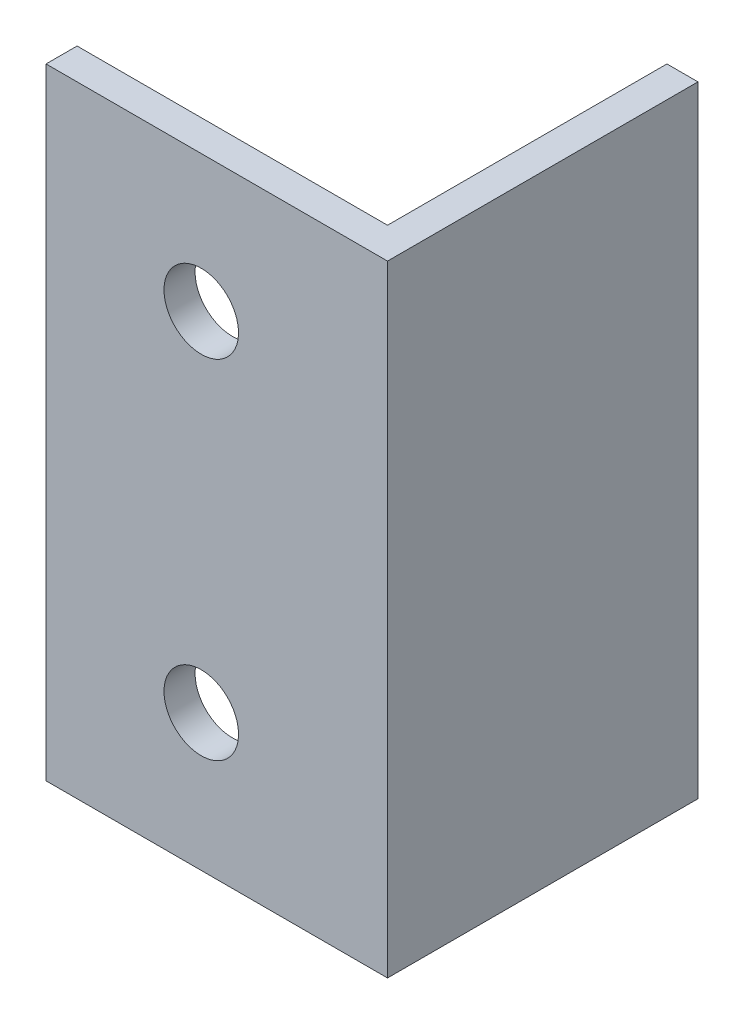
ISO-10303-21;
HEADER;
FILE_DESCRIPTION(('STEP AP214'),'2;1');
FILE_NAME('part.step','',(''),(''),'','','');
FILE_SCHEMA(('AUTOMOTIVE_DESIGN { 1 0 10303 214 1 1 1 1 }'));
ENDSEC;
DATA;
#1=APPLICATION_CONTEXT('core data for automotive mechanical design processes');
#2=APPLICATION_PROTOCOL_DEFINITION('international standard','automotive_design',2000,#1);
#3=PRODUCT_CONTEXT('',#1,'mechanical');
#4=PRODUCT('Part','Part','',(#3));
#5=PRODUCT_RELATED_PRODUCT_CATEGORY('part','',(#4));
#6=PRODUCT_DEFINITION_FORMATION('','',#4);
#7=PRODUCT_DEFINITION_CONTEXT('part definition',#1,'design');
#8=PRODUCT_DEFINITION('design','',#6,#7);
#9=PRODUCT_DEFINITION_SHAPE('','',#8);
#10=(LENGTH_UNIT() NAMED_UNIT(*) SI_UNIT(.MILLI.,.METRE.));
#11=(NAMED_UNIT(*) PLANE_ANGLE_UNIT() SI_UNIT($,.RADIAN.));
#12=(NAMED_UNIT(*) SI_UNIT($,.STERADIAN.) SOLID_ANGLE_UNIT());
#13=UNCERTAINTY_MEASURE_WITH_UNIT(LENGTH_MEASURE(1.E-05),#10,'distance_accuracy_value','');
#14=(GEOMETRIC_REPRESENTATION_CONTEXT(3) GLOBAL_UNCERTAINTY_ASSIGNED_CONTEXT((#13)) GLOBAL_UNIT_ASSIGNED_CONTEXT((#10,
#11,#12)) REPRESENTATION_CONTEXT('',''));
#15=CARTESIAN_POINT('',(0.,0.,0.));
#16=DIRECTION('',(0.,0.,1.));
#17=DIRECTION('',(1.,0.,0.));
#18=AXIS2_PLACEMENT_3D('',#15,#16,#17);
#19=CARTESIAN_POINT('',(0.,100.,5.));
#20=DIRECTION('',(1.,0.,0.));
#21=DIRECTION('',(0.,0.,-1.));
#22=AXIS2_PLACEMENT_3D('',#19,#20,#21);
#23=PLANE('',#22);
#24=DIRECTION('',(0.,0.,1.));
#25=VECTOR('',#24,1.);
#26=CARTESIAN_POINT('',(0.,0.,5.));
#27=LINE('',#26,#25);
#28=CARTESIAN_POINT('',(0.,0.,0.));
#29=VERTEX_POINT('',#28);
#30=CARTESIAN_POINT('',(0.,0.,5.));
#31=VERTEX_POINT('',#30);
#32=EDGE_CURVE('E128',#29,#31,#27,.T.);
#33=ORIENTED_EDGE('',*,*,#32,.T.);
#34=DIRECTION('',(0.,-1.,0.));
#35=VECTOR('',#34,1.);
#36=CARTESIAN_POINT('',(0.,100.,5.));
#37=LINE('',#36,#35);
#38=CARTESIAN_POINT('',(0.,100.,5.));
#39=VERTEX_POINT('',#38);
#40=EDGE_CURVE('E11',#39,#31,#37,.T.);
#41=ORIENTED_EDGE('',*,*,#40,.F.);
#42=DIRECTION('',(0.,0.,1.));
#43=VECTOR('',#42,1.);
#44=CARTESIAN_POINT('',(0.,100.,5.));
#45=LINE('',#44,#43);
#46=CARTESIAN_POINT('',(0.,100.,0.));
#47=VERTEX_POINT('',#46);
#48=EDGE_CURVE('E145',#47,#39,#45,.T.);
#49=ORIENTED_EDGE('',*,*,#48,.F.);
#50=DIRECTION('',(0.,-1.,0.));
#51=VECTOR('',#50,1.);
#52=CARTESIAN_POINT('',(0.,100.,0.));
#53=LINE('',#52,#51);
#54=EDGE_CURVE('E124',#47,#29,#53,.T.);
#55=ORIENTED_EDGE('',*,*,#54,.T.);
#56=EDGE_LOOP('',(#33,#41,#49,#55));
#57=FACE_BOUND('',#56,.T.);
#58=ADVANCED_FACE('F39',(#57),#23,.F.);
#59=CARTESIAN_POINT('',(55.,100.,4.99999999999999));
#60=DIRECTION('',(0.,0.,-1.));
#61=DIRECTION('',(-1.,0.,0.));
#62=AXIS2_PLACEMENT_3D('',#59,#60,#61);
#63=PLANE('',#62);
#64=CARTESIAN_POINT('',(25.,22.,4.99999999999999));
#65=DIRECTION('',(0.,0.,-1.));
#66=DIRECTION('',(-1.,0.,0.));
#67=AXIS2_PLACEMENT_3D('',#64,#65,#66);
#68=CIRCLE('',#67,6.);
#69=CARTESIAN_POINT('',(19.,22.,4.99999999999999));
#70=VERTEX_POINT('',#69);
#71=EDGE_CURVE('E133',#70,#70,#68,.T.);
#72=ORIENTED_EDGE('',*,*,#71,.T.);
#73=EDGE_LOOP('',(#72));
#74=FACE_BOUND('',#73,.T.);
#75=CARTESIAN_POINT('',(25.,78.,4.99999999999999));
#76=DIRECTION('',(0.,0.,-1.));
#77=DIRECTION('',(-1.,0.,0.));
#78=AXIS2_PLACEMENT_3D('',#75,#76,#77);
#79=CIRCLE('',#78,6.);
#80=CARTESIAN_POINT('',(19.,78.,4.99999999999999));
#81=VERTEX_POINT('',#80);
#82=EDGE_CURVE('E249',#81,#81,#79,.T.);
#83=ORIENTED_EDGE('',*,*,#82,.T.);
#84=EDGE_LOOP('',(#83));
#85=FACE_BOUND('',#84,.T.);
#86=DIRECTION('',(1.,0.,0.));
#87=VECTOR('',#86,1.);
#88=CARTESIAN_POINT('',(55.,0.,4.99999999999999));
#89=LINE('',#88,#87);
#90=CARTESIAN_POINT('',(55.,0.,4.99999999999999));
#91=VERTEX_POINT('',#90);
#92=EDGE_CURVE('E132',#31,#91,#89,.T.);
#93=ORIENTED_EDGE('',*,*,#92,.T.);
#94=DIRECTION('',(0.,-1.,0.));
#95=VECTOR('',#94,1.);
#96=CARTESIAN_POINT('',(55.,100.,4.99999999999999));
#97=LINE('',#96,#95);
#98=CARTESIAN_POINT('',(55.,100.,4.99999999999999));
#99=VERTEX_POINT('',#98);
#100=EDGE_CURVE('E48',#99,#91,#97,.T.);
#101=ORIENTED_EDGE('',*,*,#100,.F.);
#102=DIRECTION('',(1.,0.,0.));
#103=VECTOR('',#102,1.);
#104=CARTESIAN_POINT('',(55.,100.,4.99999999999999));
#105=LINE('',#104,#103);
#106=EDGE_CURVE('E93',#39,#99,#105,.T.);
#107=ORIENTED_EDGE('',*,*,#106,.F.);
#108=ORIENTED_EDGE('',*,*,#40,.T.);
#109=EDGE_LOOP('',(#93,#101,#107,#108));
#110=FACE_BOUND('',#109,.T.);
#111=ADVANCED_FACE('F176',(#74,#85,#110),#63,.F.);
#112=CARTESIAN_POINT('',(55.,100.,-45.));
#113=DIRECTION('',(-1.,0.,0.));
#114=DIRECTION('',(0.,0.,1.));
#115=AXIS2_PLACEMENT_3D('',#112,#113,#114);
#116=PLANE('',#115);
#117=DIRECTION('',(0.,0.,-1.));
#118=VECTOR('',#117,1.);
#119=CARTESIAN_POINT('',(55.,0.,-45.));
#120=LINE('',#119,#118);
#121=CARTESIAN_POINT('',(55.,0.,-45.));
#122=VERTEX_POINT('',#121);
#123=EDGE_CURVE('E136',#91,#122,#120,.T.);
#124=ORIENTED_EDGE('',*,*,#123,.T.);
#125=DIRECTION('',(0.,-1.,0.));
#126=VECTOR('',#125,1.);
#127=CARTESIAN_POINT('',(55.,100.,-45.));
#128=LINE('',#127,#126);
#129=CARTESIAN_POINT('',(55.,100.,-45.));
#130=VERTEX_POINT('',#129);
#131=EDGE_CURVE('E117',#130,#122,#128,.T.);
#132=ORIENTED_EDGE('',*,*,#131,.F.);
#133=DIRECTION('',(0.,0.,-1.));
#134=VECTOR('',#133,1.);
#135=CARTESIAN_POINT('',(55.,100.,-45.));
#136=LINE('',#135,#134);
#137=EDGE_CURVE('E106',#99,#130,#136,.T.);
#138=ORIENTED_EDGE('',*,*,#137,.F.);
#139=ORIENTED_EDGE('',*,*,#100,.T.);
#140=EDGE_LOOP('',(#124,#132,#138,#139));
#141=FACE_BOUND('',#140,.T.);
#142=ADVANCED_FACE('F155',(#141),#116,.F.);
#143=CARTESIAN_POINT('',(50.,100.,-45.));
#144=DIRECTION('',(0.,0.,1.));
#145=DIRECTION('',(1.,0.,0.));
#146=AXIS2_PLACEMENT_3D('',#143,#144,#145);
#147=PLANE('',#146);
#148=DIRECTION('',(-1.,0.,0.));
#149=VECTOR('',#148,1.);
#150=CARTESIAN_POINT('',(50.,0.,-45.));
#151=LINE('',#150,#149);
#152=CARTESIAN_POINT('',(50.,0.,-45.));
#153=VERTEX_POINT('',#152);
#154=EDGE_CURVE('E115',#122,#153,#151,.T.);
#155=ORIENTED_EDGE('',*,*,#154,.T.);
#156=DIRECTION('',(0.,-1.,0.));
#157=VECTOR('',#156,1.);
#158=CARTESIAN_POINT('',(50.,100.,-45.));
#159=LINE('',#158,#157);
#160=CARTESIAN_POINT('',(50.,100.,-45.));
#161=VERTEX_POINT('',#160);
#162=EDGE_CURVE('E112',#161,#153,#159,.T.);
#163=ORIENTED_EDGE('',*,*,#162,.F.);
#164=DIRECTION('',(-1.,0.,0.));
#165=VECTOR('',#164,1.);
#166=CARTESIAN_POINT('',(50.,100.,-45.));
#167=LINE('',#166,#165);
#168=EDGE_CURVE('E100',#130,#161,#167,.T.);
#169=ORIENTED_EDGE('',*,*,#168,.F.);
#170=ORIENTED_EDGE('',*,*,#131,.T.);
#171=EDGE_LOOP('',(#155,#163,#169,#170));
#172=FACE_BOUND('',#171,.T.);
#173=ADVANCED_FACE('F113',(#172),#147,.F.);
#174=CARTESIAN_POINT('',(50.,100.,0.));
#175=DIRECTION('',(1.,0.,0.));
#176=DIRECTION('',(0.,0.,-1.));
#177=AXIS2_PLACEMENT_3D('',#174,#175,#176);
#178=PLANE('',#177);
#179=DIRECTION('',(0.,0.,1.));
#180=VECTOR('',#179,1.);
#181=CARTESIAN_POINT('',(50.,0.,0.));
#182=LINE('',#181,#180);
#183=CARTESIAN_POINT('',(50.,0.,0.));
#184=VERTEX_POINT('',#183);
#185=EDGE_CURVE('E79',#153,#184,#182,.T.);
#186=ORIENTED_EDGE('',*,*,#185,.T.);
#187=DIRECTION('',(0.,-1.,0.));
#188=VECTOR('',#187,1.);
#189=CARTESIAN_POINT('',(50.,100.,0.));
#190=LINE('',#189,#188);
#191=CARTESIAN_POINT('',(50.,100.,0.));
#192=VERTEX_POINT('',#191);
#193=EDGE_CURVE('E118',#192,#184,#190,.T.);
#194=ORIENTED_EDGE('',*,*,#193,.F.);
#195=DIRECTION('',(0.,0.,1.));
#196=VECTOR('',#195,1.);
#197=CARTESIAN_POINT('',(50.,100.,0.));
#198=LINE('',#197,#196);
#199=EDGE_CURVE('E104',#161,#192,#198,.T.);
#200=ORIENTED_EDGE('',*,*,#199,.F.);
#201=ORIENTED_EDGE('',*,*,#162,.T.);
#202=EDGE_LOOP('',(#186,#194,#200,#201));
#203=FACE_BOUND('',#202,.T.);
#204=ADVANCED_FACE('F120',(#203),#178,.F.);
#205=CARTESIAN_POINT('',(0.,100.,0.));
#206=DIRECTION('',(0.,0.,1.));
#207=DIRECTION('',(1.,0.,0.));
#208=AXIS2_PLACEMENT_3D('',#205,#206,#207);
#209=PLANE('',#208);
#210=CARTESIAN_POINT('',(25.,22.,0.));
#211=DIRECTION('',(0.,0.,-1.));
#212=DIRECTION('',(-1.,0.,0.));
#213=AXIS2_PLACEMENT_3D('',#210,#211,#212);
#214=CIRCLE('',#213,6.);
#215=CARTESIAN_POINT('',(19.,22.,0.));
#216=VERTEX_POINT('',#215);
#217=EDGE_CURVE('E246',#216,#216,#214,.T.);
#218=ORIENTED_EDGE('',*,*,#217,.F.);
#219=EDGE_LOOP('',(#218));
#220=FACE_BOUND('',#219,.T.);
#221=CARTESIAN_POINT('',(25.,78.,0.));
#222=DIRECTION('',(0.,0.,-1.));
#223=DIRECTION('',(-1.,0.,0.));
#224=AXIS2_PLACEMENT_3D('',#221,#222,#223);
#225=CIRCLE('',#224,6.);
#226=CARTESIAN_POINT('',(19.,78.,0.));
#227=VERTEX_POINT('',#226);
#228=EDGE_CURVE('E260',#227,#227,#225,.T.);
#229=ORIENTED_EDGE('',*,*,#228,.F.);
#230=EDGE_LOOP('',(#229));
#231=FACE_BOUND('',#230,.T.);
#232=DIRECTION('',(-1.,0.,0.));
#233=VECTOR('',#232,1.);
#234=CARTESIAN_POINT('',(0.,0.,0.));
#235=LINE('',#234,#233);
#236=EDGE_CURVE('E85',#184,#29,#235,.T.);
#237=ORIENTED_EDGE('',*,*,#236,.T.);
#238=ORIENTED_EDGE('',*,*,#54,.F.);
#239=DIRECTION('',(-1.,0.,0.));
#240=VECTOR('',#239,1.);
#241=CARTESIAN_POINT('',(0.,100.,0.));
#242=LINE('',#241,#240);
#243=EDGE_CURVE('E56',#192,#47,#242,.T.);
#244=ORIENTED_EDGE('',*,*,#243,.F.);
#245=ORIENTED_EDGE('',*,*,#193,.T.);
#246=EDGE_LOOP('',(#237,#238,#244,#245));
#247=FACE_BOUND('',#246,.T.);
#248=ADVANCED_FACE('F162',(#220,#231,#247),#209,.F.);
#249=CARTESIAN_POINT('',(0.,100.,0.));
#250=DIRECTION('',(0.,-1.,0.));
#251=DIRECTION('',(0.,0.,-1.));
#252=AXIS2_PLACEMENT_3D('',#249,#250,#251);
#253=PLANE('',#252);
#254=ORIENTED_EDGE('',*,*,#48,.T.);
#255=ORIENTED_EDGE('',*,*,#106,.T.);
#256=ORIENTED_EDGE('',*,*,#137,.T.);
#257=ORIENTED_EDGE('',*,*,#168,.T.);
#258=ORIENTED_EDGE('',*,*,#199,.T.);
#259=ORIENTED_EDGE('',*,*,#243,.T.);
#260=EDGE_LOOP('',(#254,#255,#256,#257,#258,#259));
#261=FACE_BOUND('',#260,.T.);
#262=ADVANCED_FACE('F102',(#261),#253,.F.);
#263=CARTESIAN_POINT('',(0.,0.,0.));
#264=DIRECTION('',(0.,-1.,0.));
#265=DIRECTION('',(0.,0.,-1.));
#266=AXIS2_PLACEMENT_3D('',#263,#264,#265);
#267=PLANE('',#266);
#268=ORIENTED_EDGE('',*,*,#32,.F.);
#269=ORIENTED_EDGE('',*,*,#236,.F.);
#270=ORIENTED_EDGE('',*,*,#185,.F.);
#271=ORIENTED_EDGE('',*,*,#154,.F.);
#272=ORIENTED_EDGE('',*,*,#123,.F.);
#273=ORIENTED_EDGE('',*,*,#92,.F.);
#274=EDGE_LOOP('',(#268,#269,#270,#271,#272,#273));
#275=FACE_BOUND('',#274,.T.);
#276=ADVANCED_FACE('F158',(#275),#267,.T.);
#277=CARTESIAN_POINT('',(25.,78.,100.));
#278=DIRECTION('',(0.,0.,-1.));
#279=DIRECTION('',(-1.,0.,0.));
#280=AXIS2_PLACEMENT_3D('',#277,#278,#279);
#281=CYLINDRICAL_SURFACE('',#280,6.);
#282=ORIENTED_EDGE('',*,*,#228,.T.);
#283=EDGE_LOOP('',(#282));
#284=FACE_BOUND('',#283,.T.);
#285=ORIENTED_EDGE('',*,*,#82,.F.);
#286=EDGE_LOOP('',(#285));
#287=FACE_BOUND('',#286,.T.);
#288=ADVANCED_FACE('F212',(#284,#287),#281,.F.);
#289=CARTESIAN_POINT('',(25.,22.,100.));
#290=DIRECTION('',(0.,0.,-1.));
#291=DIRECTION('',(-1.,0.,0.));
#292=AXIS2_PLACEMENT_3D('',#289,#290,#291);
#293=CYLINDRICAL_SURFACE('',#292,6.);
#294=ORIENTED_EDGE('',*,*,#217,.T.);
#295=EDGE_LOOP('',(#294));
#296=FACE_BOUND('',#295,.T.);
#297=ORIENTED_EDGE('',*,*,#71,.F.);
#298=EDGE_LOOP('',(#297));
#299=FACE_BOUND('',#298,.T.);
#300=ADVANCED_FACE('F230',(#296,#299),#293,.F.);
#301=CLOSED_SHELL('',(#58,#111,#142,#173,#204,#248,#262,#276,#288,#300));
#302=MANIFOLD_SOLID_BREP('B2',#301);
#303=ADVANCED_BREP_SHAPE_REPRESENTATION('',(#18,#302),#14);
#304=SHAPE_DEFINITION_REPRESENTATION(#9,#303);
ENDSEC;
END-ISO-10303-21;
